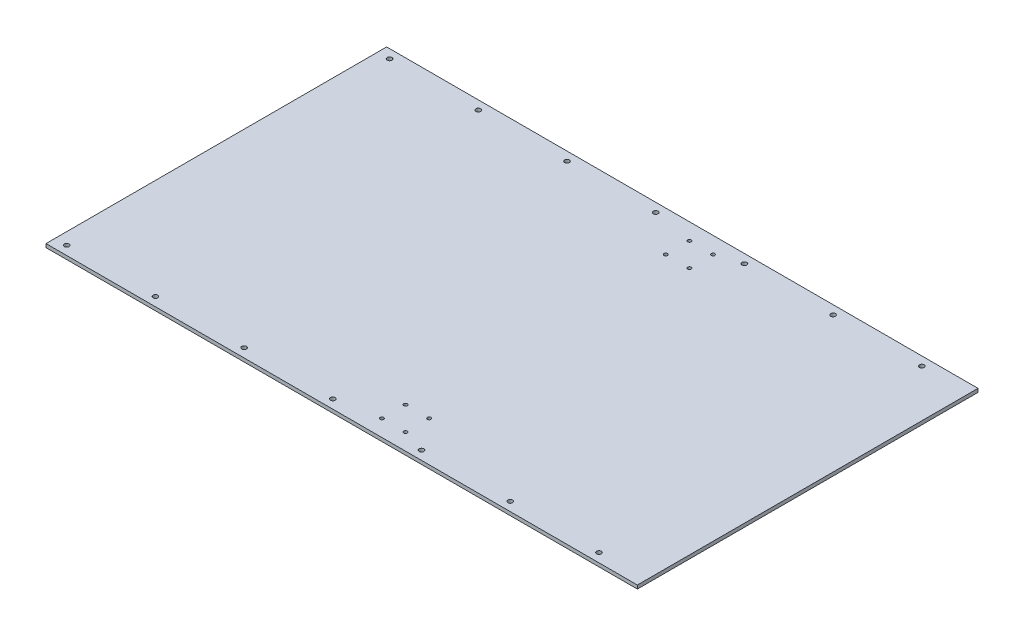
ISO-10303-21;
HEADER;
FILE_DESCRIPTION(('STEP AP214'),'2;1');
FILE_NAME('part.step','',(''),(''),'','','');
FILE_SCHEMA(('AUTOMOTIVE_DESIGN { 1 0 10303 214 1 1 1 1 }'));
ENDSEC;
DATA;
#1=APPLICATION_CONTEXT('core data for automotive mechanical design processes');
#2=APPLICATION_PROTOCOL_DEFINITION('international standard','automotive_design',2000,#1);
#3=PRODUCT_CONTEXT('',#1,'mechanical');
#4=PRODUCT('Part','Part','',(#3));
#5=PRODUCT_RELATED_PRODUCT_CATEGORY('part','',(#4));
#6=PRODUCT_DEFINITION_FORMATION('','',#4);
#7=PRODUCT_DEFINITION_CONTEXT('part definition',#1,'design');
#8=PRODUCT_DEFINITION('design','',#6,#7);
#9=PRODUCT_DEFINITION_SHAPE('','',#8);
#10=(LENGTH_UNIT() NAMED_UNIT(*) SI_UNIT(.MILLI.,.METRE.));
#11=(NAMED_UNIT(*) PLANE_ANGLE_UNIT() SI_UNIT($,.RADIAN.));
#12=(NAMED_UNIT(*) SI_UNIT($,.STERADIAN.) SOLID_ANGLE_UNIT());
#13=UNCERTAINTY_MEASURE_WITH_UNIT(LENGTH_MEASURE(1.E-05),#10,'distance_accuracy_value','');
#14=(GEOMETRIC_REPRESENTATION_CONTEXT(3) GLOBAL_UNCERTAINTY_ASSIGNED_CONTEXT((#13)) GLOBAL_UNIT_ASSIGNED_CONTEXT((#10,
#11,#12)) REPRESENTATION_CONTEXT('',''));
#15=CARTESIAN_POINT('',(0.,0.,0.));
#16=DIRECTION('',(0.,0.,1.));
#17=DIRECTION('',(1.,0.,0.));
#18=AXIS2_PLACEMENT_3D('',#15,#16,#17);
#19=CARTESIAN_POINT('',(-250.,3.,144.));
#20=DIRECTION('',(1.,0.,0.));
#21=DIRECTION('',(0.,0.,-1.));
#22=AXIS2_PLACEMENT_3D('',#19,#20,#21);
#23=PLANE('',#22);
#24=DIRECTION('',(0.,0.,1.));
#25=VECTOR('',#24,1.);
#26=CARTESIAN_POINT('',(-250.,0.,144.));
#27=LINE('',#26,#25);
#28=CARTESIAN_POINT('',(-250.,0.,-144.));
#29=VERTEX_POINT('',#28);
#30=CARTESIAN_POINT('',(-250.,0.,144.));
#31=VERTEX_POINT('',#30);
#32=EDGE_CURVE('E99',#29,#31,#27,.T.);
#33=ORIENTED_EDGE('',*,*,#32,.T.);
#34=DIRECTION('',(0.,-1.,0.));
#35=VECTOR('',#34,1.);
#36=CARTESIAN_POINT('',(-250.,3.,144.));
#37=LINE('',#36,#35);
#38=CARTESIAN_POINT('',(-250.,3.,144.));
#39=VERTEX_POINT('',#38);
#40=EDGE_CURVE('E11',#39,#31,#37,.T.);
#41=ORIENTED_EDGE('',*,*,#40,.F.);
#42=DIRECTION('',(0.,0.,1.));
#43=VECTOR('',#42,1.);
#44=CARTESIAN_POINT('',(-250.,3.,144.));
#45=LINE('',#44,#43);
#46=CARTESIAN_POINT('',(-250.,3.,-144.));
#47=VERTEX_POINT('',#46);
#48=EDGE_CURVE('E86',#47,#39,#45,.T.);
#49=ORIENTED_EDGE('',*,*,#48,.F.);
#50=DIRECTION('',(0.,-1.,0.));
#51=VECTOR('',#50,1.);
#52=CARTESIAN_POINT('',(-250.,3.,-144.));
#53=LINE('',#52,#51);
#54=EDGE_CURVE('E95',#47,#29,#53,.T.);
#55=ORIENTED_EDGE('',*,*,#54,.T.);
#56=EDGE_LOOP('',(#33,#41,#49,#55));
#57=FACE_BOUND('',#56,.T.);
#58=ADVANCED_FACE('F33',(#57),#23,.F.);
#59=CARTESIAN_POINT('',(250.,3.,144.));
#60=DIRECTION('',(0.,0.,-1.));
#61=DIRECTION('',(-1.,0.,0.));
#62=AXIS2_PLACEMENT_3D('',#59,#60,#61);
#63=PLANE('',#62);
#64=DIRECTION('',(1.,0.,0.));
#65=VECTOR('',#64,1.);
#66=CARTESIAN_POINT('',(250.,0.,144.));
#67=LINE('',#66,#65);
#68=CARTESIAN_POINT('',(250.,0.,144.));
#69=VERTEX_POINT('',#68);
#70=EDGE_CURVE('E90',#31,#69,#67,.T.);
#71=ORIENTED_EDGE('',*,*,#70,.T.);
#72=DIRECTION('',(0.,-1.,0.));
#73=VECTOR('',#72,1.);
#74=CARTESIAN_POINT('',(250.,3.,144.));
#75=LINE('',#74,#73);
#76=CARTESIAN_POINT('',(250.,3.,144.));
#77=VERTEX_POINT('',#76);
#78=EDGE_CURVE('E42',#77,#69,#75,.T.);
#79=ORIENTED_EDGE('',*,*,#78,.F.);
#80=DIRECTION('',(1.,0.,0.));
#81=VECTOR('',#80,1.);
#82=CARTESIAN_POINT('',(250.,3.,144.));
#83=LINE('',#82,#81);
#84=EDGE_CURVE('E81',#39,#77,#83,.T.);
#85=ORIENTED_EDGE('',*,*,#84,.F.);
#86=ORIENTED_EDGE('',*,*,#40,.T.);
#87=EDGE_LOOP('',(#71,#79,#85,#86));
#88=FACE_BOUND('',#87,.T.);
#89=ADVANCED_FACE('F89',(#88),#63,.F.);
#90=CARTESIAN_POINT('',(250.,3.,144.));
#91=DIRECTION('',(-1.,0.,0.));
#92=DIRECTION('',(0.,0.,1.));
#93=AXIS2_PLACEMENT_3D('',#90,#91,#92);
#94=PLANE('',#93);
#95=DIRECTION('',(0.,0.,-1.));
#96=VECTOR('',#95,1.);
#97=CARTESIAN_POINT('',(250.,0.,144.));
#98=LINE('',#97,#96);
#99=CARTESIAN_POINT('',(250.,0.,-144.));
#100=VERTEX_POINT('',#99);
#101=EDGE_CURVE('E68',#69,#100,#98,.T.);
#102=ORIENTED_EDGE('',*,*,#101,.T.);
#103=DIRECTION('',(0.,-1.,0.));
#104=VECTOR('',#103,1.);
#105=CARTESIAN_POINT('',(250.,3.,-144.));
#106=LINE('',#105,#104);
#107=CARTESIAN_POINT('',(250.,3.,-144.));
#108=VERTEX_POINT('',#107);
#109=EDGE_CURVE('E91',#108,#100,#106,.T.);
#110=ORIENTED_EDGE('',*,*,#109,.F.);
#111=DIRECTION('',(0.,0.,-1.));
#112=VECTOR('',#111,1.);
#113=CARTESIAN_POINT('',(250.,3.,144.));
#114=LINE('',#113,#112);
#115=EDGE_CURVE('E84',#77,#108,#114,.T.);
#116=ORIENTED_EDGE('',*,*,#115,.F.);
#117=ORIENTED_EDGE('',*,*,#78,.T.);
#118=EDGE_LOOP('',(#102,#110,#116,#117));
#119=FACE_BOUND('',#118,.T.);
#120=ADVANCED_FACE('F93',(#119),#94,.F.);
#121=CARTESIAN_POINT('',(250.,3.,-144.));
#122=DIRECTION('',(0.,0.,1.));
#123=DIRECTION('',(1.,0.,0.));
#124=AXIS2_PLACEMENT_3D('',#121,#122,#123);
#125=PLANE('',#124);
#126=DIRECTION('',(-1.,0.,0.));
#127=VECTOR('',#126,1.);
#128=CARTESIAN_POINT('',(250.,0.,-144.));
#129=LINE('',#128,#127);
#130=EDGE_CURVE('E74',#100,#29,#129,.T.);
#131=ORIENTED_EDGE('',*,*,#130,.T.);
#132=ORIENTED_EDGE('',*,*,#54,.F.);
#133=DIRECTION('',(-1.,0.,0.));
#134=VECTOR('',#133,1.);
#135=CARTESIAN_POINT('',(250.,3.,-144.));
#136=LINE('',#135,#134);
#137=EDGE_CURVE('E51',#108,#47,#136,.T.);
#138=ORIENTED_EDGE('',*,*,#137,.F.);
#139=ORIENTED_EDGE('',*,*,#109,.T.);
#140=EDGE_LOOP('',(#131,#132,#138,#139));
#141=FACE_BOUND('',#140,.T.);
#142=ADVANCED_FACE('F189',(#141),#125,.F.);
#143=CARTESIAN_POINT('',(0.,3.,0.));
#144=DIRECTION('',(0.,1.,0.));
#145=DIRECTION('',(0.,0.,1.));
#146=AXIS2_PLACEMENT_3D('',#143,#144,#145);
#147=PLANE('',#146);
#148=CARTESIAN_POINT('',(20.0000000000043,3.,-129.999999999998));
#149=DIRECTION('',(0.,1.,0.));
#150=DIRECTION('',(0.,0.,1.));
#151=AXIS2_PLACEMENT_3D('',#148,#149,#150);
#152=CIRCLE('',#151,1.5);
#153=CARTESIAN_POINT('',(20.0000000000043,3.,-128.499999999998));
#154=VERTEX_POINT('',#153);
#155=EDGE_CURVE('E394',#154,#154,#152,.T.);
#156=ORIENTED_EDGE('',*,*,#155,.F.);
#157=EDGE_LOOP('',(#156));
#158=FACE_BOUND('',#157,.T.);
#159=CARTESIAN_POINT('',(40.0000000000052,3.,-109.999999999997));
#160=DIRECTION('',(0.,1.,0.));
#161=DIRECTION('',(0.,0.,1.));
#162=AXIS2_PLACEMENT_3D('',#159,#160,#161);
#163=CIRCLE('',#162,1.5);
#164=CARTESIAN_POINT('',(40.0000000000052,3.,-108.499999999997));
#165=VERTEX_POINT('',#164);
#166=EDGE_CURVE('E434',#165,#165,#163,.T.);
#167=ORIENTED_EDGE('',*,*,#166,.F.);
#168=EDGE_LOOP('',(#167));
#169=FACE_BOUND('',#168,.T.);
#170=CARTESIAN_POINT('',(20.0000000000052,3.,-109.999999999997));
#171=DIRECTION('',(0.,1.,0.));
#172=DIRECTION('',(0.,0.,1.));
#173=AXIS2_PLACEMENT_3D('',#170,#171,#172);
#174=CIRCLE('',#173,1.5);
#175=CARTESIAN_POINT('',(20.0000000000052,3.,-108.499999999997));
#176=VERTEX_POINT('',#175);
#177=EDGE_CURVE('E431',#176,#176,#174,.T.);
#178=ORIENTED_EDGE('',*,*,#177,.F.);
#179=EDGE_LOOP('',(#178));
#180=FACE_BOUND('',#179,.T.);
#181=CARTESIAN_POINT('',(40.0000000000068,3.,110.000000000003));
#182=DIRECTION('',(0.,1.,0.));
#183=DIRECTION('',(0.,0.,1.));
#184=AXIS2_PLACEMENT_3D('',#181,#182,#183);
#185=CIRCLE('',#184,1.5);
#186=CARTESIAN_POINT('',(40.0000000000068,3.,111.500000000003));
#187=VERTEX_POINT('',#186);
#188=EDGE_CURVE('E428',#187,#187,#185,.T.);
#189=ORIENTED_EDGE('',*,*,#188,.F.);
#190=EDGE_LOOP('',(#189));
#191=FACE_BOUND('',#190,.T.);
#192=CARTESIAN_POINT('',(40.0000000000069,3.,130.000000000003));
#193=DIRECTION('',(0.,1.,0.));
#194=DIRECTION('',(0.,0.,1.));
#195=AXIS2_PLACEMENT_3D('',#192,#193,#194);
#196=CIRCLE('',#195,1.49999999999999);
#197=CARTESIAN_POINT('',(40.0000000000069,3.,131.500000000003));
#198=VERTEX_POINT('',#197);
#199=EDGE_CURVE('E425',#198,#198,#196,.T.);
#200=ORIENTED_EDGE('',*,*,#199,.F.);
#201=EDGE_LOOP('',(#200));
#202=FACE_BOUND('',#201,.T.);
#203=CARTESIAN_POINT('',(20.0000000000069,3.,130.000000000003));
#204=DIRECTION('',(0.,1.,0.));
#205=DIRECTION('',(0.,0.,1.));
#206=AXIS2_PLACEMENT_3D('',#203,#204,#205);
#207=CIRCLE('',#206,1.49999999999999);
#208=CARTESIAN_POINT('',(20.0000000000069,3.,131.500000000003));
#209=VERTEX_POINT('',#208);
#210=EDGE_CURVE('E422',#209,#209,#207,.T.);
#211=ORIENTED_EDGE('',*,*,#210,.F.);
#212=EDGE_LOOP('',(#211));
#213=FACE_BOUND('',#212,.T.);
#214=CARTESIAN_POINT('',(40.0000000000051,3.,-129.999999999997));
#215=DIRECTION('',(0.,1.,0.));
#216=DIRECTION('',(0.,0.,1.));
#217=AXIS2_PLACEMENT_3D('',#214,#215,#216);
#218=CIRCLE('',#217,1.49999999999998);
#219=CARTESIAN_POINT('',(40.0000000000051,3.,-128.499999999997));
#220=VERTEX_POINT('',#219);
#221=EDGE_CURVE('E419',#220,#220,#218,.T.);
#222=ORIENTED_EDGE('',*,*,#221,.F.);
#223=EDGE_LOOP('',(#222));
#224=FACE_BOUND('',#223,.T.);
#225=CARTESIAN_POINT('',(20.0000000000068,3.,110.000000000003));
#226=DIRECTION('',(0.,1.,0.));
#227=DIRECTION('',(0.,0.,1.));
#228=AXIS2_PLACEMENT_3D('',#225,#226,#227);
#229=CIRCLE('',#228,1.5);
#230=CARTESIAN_POINT('',(20.0000000000068,3.,111.500000000003));
#231=VERTEX_POINT('',#230);
#232=EDGE_CURVE('E416',#231,#231,#229,.T.);
#233=ORIENTED_EDGE('',*,*,#232,.F.);
#234=EDGE_LOOP('',(#233));
#235=FACE_BOUND('',#234,.T.);
#236=CARTESIAN_POINT('',(-15.,3.,136.5));
#237=DIRECTION('',(0.,1.,0.));
#238=DIRECTION('',(0.,0.,-1.));
#239=AXIS2_PLACEMENT_3D('',#236,#237,#238);
#240=CIRCLE('',#239,2.);
#241=CARTESIAN_POINT('',(-15.,3.,134.5));
#242=VERTEX_POINT('',#241);
#243=EDGE_CURVE('E451',#242,#242,#240,.T.);
#244=ORIENTED_EDGE('',*,*,#243,.F.);
#245=EDGE_LOOP('',(#244));
#246=FACE_BOUND('',#245,.T.);
#247=CARTESIAN_POINT('',(60.,3.,136.5));
#248=DIRECTION('',(0.,1.,0.));
#249=DIRECTION('',(0.,0.,-1.));
#250=AXIS2_PLACEMENT_3D('',#247,#248,#249);
#251=CIRCLE('',#250,2.);
#252=CARTESIAN_POINT('',(60.,3.,134.5));
#253=VERTEX_POINT('',#252);
#254=EDGE_CURVE('E461',#253,#253,#251,.T.);
#255=ORIENTED_EDGE('',*,*,#254,.F.);
#256=EDGE_LOOP('',(#255));
#257=FACE_BOUND('',#256,.T.);
#258=CARTESIAN_POINT('',(135.,3.,136.5));
#259=DIRECTION('',(0.,1.,0.));
#260=DIRECTION('',(0.,0.,-1.));
#261=AXIS2_PLACEMENT_3D('',#258,#259,#260);
#262=CIRCLE('',#261,2.);
#263=CARTESIAN_POINT('',(135.,3.,134.5));
#264=VERTEX_POINT('',#263);
#265=EDGE_CURVE('E458',#264,#264,#262,.T.);
#266=ORIENTED_EDGE('',*,*,#265,.F.);
#267=EDGE_LOOP('',(#266));
#268=FACE_BOUND('',#267,.T.);
#269=CARTESIAN_POINT('',(135.,3.,-136.5));
#270=DIRECTION('',(0.,1.,0.));
#271=DIRECTION('',(0.,0.,1.));
#272=AXIS2_PLACEMENT_3D('',#269,#270,#271);
#273=CIRCLE('',#272,2.);
#274=CARTESIAN_POINT('',(135.,3.,-134.5));
#275=VERTEX_POINT('',#274);
#276=EDGE_CURVE('E454',#275,#275,#273,.T.);
#277=ORIENTED_EDGE('',*,*,#276,.F.);
#278=EDGE_LOOP('',(#277));
#279=FACE_BOUND('',#278,.T.);
#280=CARTESIAN_POINT('',(60.,3.,-136.5));
#281=DIRECTION('',(0.,1.,0.));
#282=DIRECTION('',(0.,0.,1.));
#283=AXIS2_PLACEMENT_3D('',#280,#281,#282);
#284=CIRCLE('',#283,2.);
#285=CARTESIAN_POINT('',(60.,3.,-134.5));
#286=VERTEX_POINT('',#285);
#287=EDGE_CURVE('E457',#286,#286,#284,.T.);
#288=ORIENTED_EDGE('',*,*,#287,.F.);
#289=EDGE_LOOP('',(#288));
#290=FACE_BOUND('',#289,.T.);
#291=CARTESIAN_POINT('',(-15.,3.,-136.5));
#292=DIRECTION('',(0.,1.,0.));
#293=DIRECTION('',(0.,0.,1.));
#294=AXIS2_PLACEMENT_3D('',#291,#292,#293);
#295=CIRCLE('',#294,2.);
#296=CARTESIAN_POINT('',(-15.,3.,-134.5));
#297=VERTEX_POINT('',#296);
#298=EDGE_CURVE('E471',#297,#297,#295,.T.);
#299=ORIENTED_EDGE('',*,*,#298,.F.);
#300=EDGE_LOOP('',(#299));
#301=FACE_BOUND('',#300,.T.);
#302=CARTESIAN_POINT('',(-90.,3.,-136.5));
#303=DIRECTION('',(0.,1.,0.));
#304=DIRECTION('',(0.,0.,1.));
#305=AXIS2_PLACEMENT_3D('',#302,#303,#304);
#306=CIRCLE('',#305,2.);
#307=CARTESIAN_POINT('',(-90.,3.,-134.5));
#308=VERTEX_POINT('',#307);
#309=EDGE_CURVE('E468',#308,#308,#306,.T.);
#310=ORIENTED_EDGE('',*,*,#309,.F.);
#311=EDGE_LOOP('',(#310));
#312=FACE_BOUND('',#311,.T.);
#313=CARTESIAN_POINT('',(-165.,3.,-136.5));
#314=DIRECTION('',(0.,1.,0.));
#315=DIRECTION('',(0.,0.,1.));
#316=AXIS2_PLACEMENT_3D('',#313,#314,#315);
#317=CIRCLE('',#316,2.);
#318=CARTESIAN_POINT('',(-165.,3.,-134.5));
#319=VERTEX_POINT('',#318);
#320=EDGE_CURVE('E465',#319,#319,#317,.T.);
#321=ORIENTED_EDGE('',*,*,#320,.F.);
#322=EDGE_LOOP('',(#321));
#323=FACE_BOUND('',#322,.T.);
#324=CARTESIAN_POINT('',(210.,3.,136.5));
#325=DIRECTION('',(0.,1.,0.));
#326=DIRECTION('',(0.,0.,-1.));
#327=AXIS2_PLACEMENT_3D('',#324,#325,#326);
#328=CIRCLE('',#327,2.);
#329=CARTESIAN_POINT('',(210.,3.,134.5));
#330=VERTEX_POINT('',#329);
#331=EDGE_CURVE('E438',#330,#330,#328,.T.);
#332=ORIENTED_EDGE('',*,*,#331,.F.);
#333=EDGE_LOOP('',(#332));
#334=FACE_BOUND('',#333,.T.);
#335=CARTESIAN_POINT('',(-90.,3.,136.5));
#336=DIRECTION('',(0.,1.,0.));
#337=DIRECTION('',(0.,0.,-1.));
#338=AXIS2_PLACEMENT_3D('',#335,#336,#337);
#339=CIRCLE('',#338,2.);
#340=CARTESIAN_POINT('',(-90.,3.,134.5));
#341=VERTEX_POINT('',#340);
#342=EDGE_CURVE('E448',#341,#341,#339,.T.);
#343=ORIENTED_EDGE('',*,*,#342,.F.);
#344=EDGE_LOOP('',(#343));
#345=FACE_BOUND('',#344,.T.);
#346=CARTESIAN_POINT('',(-165.,3.,136.5));
#347=DIRECTION('',(0.,1.,0.));
#348=DIRECTION('',(0.,0.,-1.));
#349=AXIS2_PLACEMENT_3D('',#346,#347,#348);
#350=CIRCLE('',#349,2.);
#351=CARTESIAN_POINT('',(-165.,3.,134.5));
#352=VERTEX_POINT('',#351);
#353=EDGE_CURVE('E445',#352,#352,#350,.T.);
#354=ORIENTED_EDGE('',*,*,#353,.F.);
#355=EDGE_LOOP('',(#354));
#356=FACE_BOUND('',#355,.T.);
#357=CARTESIAN_POINT('',(-240.,3.,136.5));
#358=DIRECTION('',(0.,1.,0.));
#359=DIRECTION('',(0.,0.,-1.));
#360=AXIS2_PLACEMENT_3D('',#357,#358,#359);
#361=CIRCLE('',#360,2.);
#362=CARTESIAN_POINT('',(-240.,3.,134.5));
#363=VERTEX_POINT('',#362);
#364=EDGE_CURVE('E442',#363,#363,#361,.T.);
#365=ORIENTED_EDGE('',*,*,#364,.F.);
#366=EDGE_LOOP('',(#365));
#367=FACE_BOUND('',#366,.T.);
#368=CARTESIAN_POINT('',(210.,3.,-136.5));
#369=DIRECTION('',(0.,1.,0.));
#370=DIRECTION('',(0.,0.,1.));
#371=AXIS2_PLACEMENT_3D('',#368,#369,#370);
#372=CIRCLE('',#371,2.);
#373=CARTESIAN_POINT('',(210.,3.,-134.5));
#374=VERTEX_POINT('',#373);
#375=EDGE_CURVE('E441',#374,#374,#372,.T.);
#376=ORIENTED_EDGE('',*,*,#375,.F.);
#377=EDGE_LOOP('',(#376));
#378=FACE_BOUND('',#377,.T.);
#379=CARTESIAN_POINT('',(-240.,3.,-136.5));
#380=DIRECTION('',(0.,1.,0.));
#381=DIRECTION('',(0.,0.,1.));
#382=AXIS2_PLACEMENT_3D('',#379,#380,#381);
#383=CIRCLE('',#382,2.);
#384=CARTESIAN_POINT('',(-240.,3.,-134.5));
#385=VERTEX_POINT('',#384);
#386=EDGE_CURVE('E111',#385,#385,#383,.T.);
#387=ORIENTED_EDGE('',*,*,#386,.F.);
#388=EDGE_LOOP('',(#387));
#389=FACE_BOUND('',#388,.T.);
#390=ORIENTED_EDGE('',*,*,#48,.T.);
#391=ORIENTED_EDGE('',*,*,#84,.T.);
#392=ORIENTED_EDGE('',*,*,#115,.T.);
#393=ORIENTED_EDGE('',*,*,#137,.T.);
#394=EDGE_LOOP('',(#390,#391,#392,#393));
#395=FACE_BOUND('',#394,.T.);
#396=ADVANCED_FACE('F82',(#158,#169,#180,#191,#202,#213,#224,#235,#246,#257,#268,#279,#290,#301,
#312,#323,#334,#345,#356,#367,#378,#389,#395),#147,.T.);
#397=CARTESIAN_POINT('',(0.,0.,0.));
#398=DIRECTION('',(0.,1.,0.));
#399=DIRECTION('',(0.,0.,1.));
#400=AXIS2_PLACEMENT_3D('',#397,#398,#399);
#401=PLANE('',#400);
#402=CARTESIAN_POINT('',(20.0000000000043,0.,-129.999999999998));
#403=DIRECTION('',(0.,-1.,0.));
#404=DIRECTION('',(0.,0.,-1.));
#405=AXIS2_PLACEMENT_3D('',#402,#403,#404);
#406=CIRCLE('',#405,1.5);
#407=CARTESIAN_POINT('',(20.0000000000043,0.,-131.499999999998));
#408=VERTEX_POINT('',#407);
#409=EDGE_CURVE('E396',#408,#408,#406,.T.);
#410=ORIENTED_EDGE('',*,*,#409,.F.);
#411=EDGE_LOOP('',(#410));
#412=FACE_BOUND('',#411,.T.);
#413=CARTESIAN_POINT('',(40.0000000000052,0.,-109.999999999997));
#414=DIRECTION('',(0.,-1.,0.));
#415=DIRECTION('',(0.,0.,-1.));
#416=AXIS2_PLACEMENT_3D('',#413,#414,#415);
#417=CIRCLE('',#416,1.5);
#418=CARTESIAN_POINT('',(40.0000000000052,0.,-111.499999999997));
#419=VERTEX_POINT('',#418);
#420=EDGE_CURVE('E397',#419,#419,#417,.T.);
#421=ORIENTED_EDGE('',*,*,#420,.F.);
#422=EDGE_LOOP('',(#421));
#423=FACE_BOUND('',#422,.T.);
#424=CARTESIAN_POINT('',(20.0000000000052,0.,-109.999999999997));
#425=DIRECTION('',(0.,-1.,0.));
#426=DIRECTION('',(0.,0.,-1.));
#427=AXIS2_PLACEMENT_3D('',#424,#425,#426);
#428=CIRCLE('',#427,1.5);
#429=CARTESIAN_POINT('',(20.0000000000052,0.,-111.499999999997));
#430=VERTEX_POINT('',#429);
#431=EDGE_CURVE('E401',#430,#430,#428,.T.);
#432=ORIENTED_EDGE('',*,*,#431,.F.);
#433=EDGE_LOOP('',(#432));
#434=FACE_BOUND('',#433,.T.);
#435=CARTESIAN_POINT('',(40.0000000000068,0.,110.000000000003));
#436=DIRECTION('',(0.,-1.,0.));
#437=DIRECTION('',(0.,0.,-1.));
#438=AXIS2_PLACEMENT_3D('',#435,#436,#437);
#439=CIRCLE('',#438,1.5);
#440=CARTESIAN_POINT('',(40.0000000000068,0.,108.500000000003));
#441=VERTEX_POINT('',#440);
#442=EDGE_CURVE('E408',#441,#441,#439,.T.);
#443=ORIENTED_EDGE('',*,*,#442,.F.);
#444=EDGE_LOOP('',(#443));
#445=FACE_BOUND('',#444,.T.);
#446=CARTESIAN_POINT('',(40.0000000000069,0.,130.000000000003));
#447=DIRECTION('',(0.,-1.,0.));
#448=DIRECTION('',(0.,0.,-1.));
#449=AXIS2_PLACEMENT_3D('',#446,#447,#448);
#450=CIRCLE('',#449,1.49999999999999);
#451=CARTESIAN_POINT('',(40.0000000000069,0.,128.500000000003));
#452=VERTEX_POINT('',#451);
#453=EDGE_CURVE('E567',#452,#452,#450,.T.);
#454=ORIENTED_EDGE('',*,*,#453,.F.);
#455=EDGE_LOOP('',(#454));
#456=FACE_BOUND('',#455,.T.);
#457=CARTESIAN_POINT('',(20.0000000000069,0.,130.000000000003));
#458=DIRECTION('',(0.,-1.,0.));
#459=DIRECTION('',(0.,0.,-1.));
#460=AXIS2_PLACEMENT_3D('',#457,#458,#459);
#461=CIRCLE('',#460,1.49999999999999);
#462=CARTESIAN_POINT('',(20.0000000000069,0.,128.500000000003));
#463=VERTEX_POINT('',#462);
#464=EDGE_CURVE('E404',#463,#463,#461,.T.);
#465=ORIENTED_EDGE('',*,*,#464,.F.);
#466=EDGE_LOOP('',(#465));
#467=FACE_BOUND('',#466,.T.);
#468=CARTESIAN_POINT('',(40.0000000000051,0.,-129.999999999997));
#469=DIRECTION('',(0.,-1.,0.));
#470=DIRECTION('',(0.,0.,-1.));
#471=AXIS2_PLACEMENT_3D('',#468,#469,#470);
#472=CIRCLE('',#471,1.49999999999998);
#473=CARTESIAN_POINT('',(40.0000000000051,0.,-131.499999999997));
#474=VERTEX_POINT('',#473);
#475=EDGE_CURVE('E398',#474,#474,#472,.T.);
#476=ORIENTED_EDGE('',*,*,#475,.F.);
#477=EDGE_LOOP('',(#476));
#478=FACE_BOUND('',#477,.T.);
#479=CARTESIAN_POINT('',(20.0000000000068,0.,110.000000000003));
#480=DIRECTION('',(0.,-1.,0.));
#481=DIRECTION('',(0.,0.,-1.));
#482=AXIS2_PLACEMENT_3D('',#479,#480,#481);
#483=CIRCLE('',#482,1.5);
#484=CARTESIAN_POINT('',(20.0000000000068,0.,108.500000000003));
#485=VERTEX_POINT('',#484);
#486=EDGE_CURVE('E411',#485,#485,#483,.T.);
#487=ORIENTED_EDGE('',*,*,#486,.F.);
#488=EDGE_LOOP('',(#487));
#489=FACE_BOUND('',#488,.T.);
#490=CARTESIAN_POINT('',(-15.,0.,136.5));
#491=DIRECTION('',(0.,1.,0.));
#492=DIRECTION('',(0.,0.,1.));
#493=AXIS2_PLACEMENT_3D('',#490,#491,#492);
#494=CIRCLE('',#493,2.);
#495=CARTESIAN_POINT('',(-15.,0.,138.5));
#496=VERTEX_POINT('',#495);
#497=EDGE_CURVE('E36',#496,#496,#494,.T.);
#498=ORIENTED_EDGE('',*,*,#497,.T.);
#499=EDGE_LOOP('',(#498));
#500=FACE_BOUND('',#499,.T.);
#501=CARTESIAN_POINT('',(60.,0.,136.5));
#502=DIRECTION('',(0.,1.,0.));
#503=DIRECTION('',(0.,0.,1.));
#504=AXIS2_PLACEMENT_3D('',#501,#502,#503);
#505=CIRCLE('',#504,2.);
#506=CARTESIAN_POINT('',(60.,0.,138.5));
#507=VERTEX_POINT('',#506);
#508=EDGE_CURVE('E143',#507,#507,#505,.T.);
#509=ORIENTED_EDGE('',*,*,#508,.T.);
#510=EDGE_LOOP('',(#509));
#511=FACE_BOUND('',#510,.T.);
#512=CARTESIAN_POINT('',(135.,0.,136.5));
#513=DIRECTION('',(0.,1.,0.));
#514=DIRECTION('',(0.,0.,1.));
#515=AXIS2_PLACEMENT_3D('',#512,#513,#514);
#516=CIRCLE('',#515,2.);
#517=CARTESIAN_POINT('',(135.,0.,138.5));
#518=VERTEX_POINT('',#517);
#519=EDGE_CURVE('E141',#518,#518,#516,.T.);
#520=ORIENTED_EDGE('',*,*,#519,.T.);
#521=EDGE_LOOP('',(#520));
#522=FACE_BOUND('',#521,.T.);
#523=CARTESIAN_POINT('',(135.,0.,-136.5));
#524=DIRECTION('',(0.,1.,0.));
#525=DIRECTION('',(0.,0.,1.));
#526=AXIS2_PLACEMENT_3D('',#523,#524,#525);
#527=CIRCLE('',#526,2.);
#528=CARTESIAN_POINT('',(135.,0.,-134.5));
#529=VERTEX_POINT('',#528);
#530=EDGE_CURVE('E138',#529,#529,#527,.T.);
#531=ORIENTED_EDGE('',*,*,#530,.T.);
#532=EDGE_LOOP('',(#531));
#533=FACE_BOUND('',#532,.T.);
#534=CARTESIAN_POINT('',(60.,0.,-136.5));
#535=DIRECTION('',(0.,1.,0.));
#536=DIRECTION('',(0.,0.,1.));
#537=AXIS2_PLACEMENT_3D('',#534,#535,#536);
#538=CIRCLE('',#537,2.);
#539=CARTESIAN_POINT('',(60.,0.,-134.5));
#540=VERTEX_POINT('',#539);
#541=EDGE_CURVE('E135',#540,#540,#538,.T.);
#542=ORIENTED_EDGE('',*,*,#541,.T.);
#543=EDGE_LOOP('',(#542));
#544=FACE_BOUND('',#543,.T.);
#545=CARTESIAN_POINT('',(-15.,0.,-136.5));
#546=DIRECTION('',(0.,1.,0.));
#547=DIRECTION('',(0.,0.,1.));
#548=AXIS2_PLACEMENT_3D('',#545,#546,#547);
#549=CIRCLE('',#548,2.);
#550=CARTESIAN_POINT('',(-15.,0.,-134.5));
#551=VERTEX_POINT('',#550);
#552=EDGE_CURVE('E132',#551,#551,#549,.T.);
#553=ORIENTED_EDGE('',*,*,#552,.T.);
#554=EDGE_LOOP('',(#553));
#555=FACE_BOUND('',#554,.T.);
#556=CARTESIAN_POINT('',(-90.,0.,-136.5));
#557=DIRECTION('',(0.,1.,0.));
#558=DIRECTION('',(0.,0.,1.));
#559=AXIS2_PLACEMENT_3D('',#556,#557,#558);
#560=CIRCLE('',#559,2.);
#561=CARTESIAN_POINT('',(-90.,0.,-134.5));
#562=VERTEX_POINT('',#561);
#563=EDGE_CURVE('E129',#562,#562,#560,.T.);
#564=ORIENTED_EDGE('',*,*,#563,.T.);
#565=EDGE_LOOP('',(#564));
#566=FACE_BOUND('',#565,.T.);
#567=CARTESIAN_POINT('',(-165.,0.,-136.5));
#568=DIRECTION('',(0.,1.,0.));
#569=DIRECTION('',(0.,0.,1.));
#570=AXIS2_PLACEMENT_3D('',#567,#568,#569);
#571=CIRCLE('',#570,2.);
#572=CARTESIAN_POINT('',(-165.,0.,-134.5));
#573=VERTEX_POINT('',#572);
#574=EDGE_CURVE('E126',#573,#573,#571,.T.);
#575=ORIENTED_EDGE('',*,*,#574,.T.);
#576=EDGE_LOOP('',(#575));
#577=FACE_BOUND('',#576,.T.);
#578=CARTESIAN_POINT('',(210.,0.,136.5));
#579=DIRECTION('',(0.,1.,0.));
#580=DIRECTION('',(0.,0.,1.));
#581=AXIS2_PLACEMENT_3D('',#578,#579,#580);
#582=CIRCLE('',#581,2.);
#583=CARTESIAN_POINT('',(210.,0.,138.5));
#584=VERTEX_POINT('',#583);
#585=EDGE_CURVE('E123',#584,#584,#582,.T.);
#586=ORIENTED_EDGE('',*,*,#585,.T.);
#587=EDGE_LOOP('',(#586));
#588=FACE_BOUND('',#587,.T.);
#589=CARTESIAN_POINT('',(-90.,0.,136.5));
#590=DIRECTION('',(0.,1.,0.));
#591=DIRECTION('',(0.,0.,1.));
#592=AXIS2_PLACEMENT_3D('',#589,#590,#591);
#593=CIRCLE('',#592,2.);
#594=CARTESIAN_POINT('',(-90.,0.,138.5));
#595=VERTEX_POINT('',#594);
#596=EDGE_CURVE('E120',#595,#595,#593,.T.);
#597=ORIENTED_EDGE('',*,*,#596,.T.);
#598=EDGE_LOOP('',(#597));
#599=FACE_BOUND('',#598,.T.);
#600=CARTESIAN_POINT('',(-165.,0.,136.5));
#601=DIRECTION('',(0.,1.,0.));
#602=DIRECTION('',(0.,0.,1.));
#603=AXIS2_PLACEMENT_3D('',#600,#601,#602);
#604=CIRCLE('',#603,2.);
#605=CARTESIAN_POINT('',(-165.,0.,138.5));
#606=VERTEX_POINT('',#605);
#607=EDGE_CURVE('E117',#606,#606,#604,.T.);
#608=ORIENTED_EDGE('',*,*,#607,.T.);
#609=EDGE_LOOP('',(#608));
#610=FACE_BOUND('',#609,.T.);
#611=CARTESIAN_POINT('',(-240.,0.,136.5));
#612=DIRECTION('',(0.,1.,0.));
#613=DIRECTION('',(0.,0.,1.));
#614=AXIS2_PLACEMENT_3D('',#611,#612,#613);
#615=CIRCLE('',#614,2.);
#616=CARTESIAN_POINT('',(-240.,0.,138.5));
#617=VERTEX_POINT('',#616);
#618=EDGE_CURVE('E114',#617,#617,#615,.T.);
#619=ORIENTED_EDGE('',*,*,#618,.T.);
#620=EDGE_LOOP('',(#619));
#621=FACE_BOUND('',#620,.T.);
#622=CARTESIAN_POINT('',(210.,0.,-136.5));
#623=DIRECTION('',(0.,1.,0.));
#624=DIRECTION('',(0.,0.,1.));
#625=AXIS2_PLACEMENT_3D('',#622,#623,#624);
#626=CIRCLE('',#625,2.);
#627=CARTESIAN_POINT('',(210.,0.,-134.5));
#628=VERTEX_POINT('',#627);
#629=EDGE_CURVE('E110',#628,#628,#626,.T.);
#630=ORIENTED_EDGE('',*,*,#629,.T.);
#631=EDGE_LOOP('',(#630));
#632=FACE_BOUND('',#631,.T.);
#633=CARTESIAN_POINT('',(-240.,0.,-136.5));
#634=DIRECTION('',(0.,1.,0.));
#635=DIRECTION('',(0.,0.,1.));
#636=AXIS2_PLACEMENT_3D('',#633,#634,#635);
#637=CIRCLE('',#636,2.);
#638=CARTESIAN_POINT('',(-240.,0.,-134.5));
#639=VERTEX_POINT('',#638);
#640=EDGE_CURVE('E107',#639,#639,#637,.T.);
#641=ORIENTED_EDGE('',*,*,#640,.T.);
#642=EDGE_LOOP('',(#641));
#643=FACE_BOUND('',#642,.T.);
#644=ORIENTED_EDGE('',*,*,#32,.F.);
#645=ORIENTED_EDGE('',*,*,#130,.F.);
#646=ORIENTED_EDGE('',*,*,#101,.F.);
#647=ORIENTED_EDGE('',*,*,#70,.F.);
#648=EDGE_LOOP('',(#644,#645,#646,#647));
#649=FACE_BOUND('',#648,.T.);
#650=ADVANCED_FACE('F150',(#412,#423,#434,#445,#456,#467,#478,#489,#500,#511,#522,#533,#544,
#555,#566,#577,#588,#599,#610,#621,#632,#643,#649),#401,.F.);
#651=CARTESIAN_POINT('',(-240.,-7.,-136.5));
#652=DIRECTION('',(0.,1.,0.));
#653=DIRECTION('',(0.,0.,1.));
#654=AXIS2_PLACEMENT_3D('',#651,#652,#653);
#655=CYLINDRICAL_SURFACE('',#654,2.);
#656=ORIENTED_EDGE('',*,*,#386,.T.);
#657=EDGE_LOOP('',(#656));
#658=FACE_BOUND('',#657,.T.);
#659=ORIENTED_EDGE('',*,*,#640,.F.);
#660=EDGE_LOOP('',(#659));
#661=FACE_BOUND('',#660,.T.);
#662=ADVANCED_FACE('F178',(#658,#661),#655,.F.);
#663=CARTESIAN_POINT('',(210.,-7.,-136.5));
#664=DIRECTION('',(0.,1.,0.));
#665=DIRECTION('',(0.,0.,1.));
#666=AXIS2_PLACEMENT_3D('',#663,#664,#665);
#667=CYLINDRICAL_SURFACE('',#666,2.);
#668=ORIENTED_EDGE('',*,*,#375,.T.);
#669=EDGE_LOOP('',(#668));
#670=FACE_BOUND('',#669,.T.);
#671=ORIENTED_EDGE('',*,*,#629,.F.);
#672=EDGE_LOOP('',(#671));
#673=FACE_BOUND('',#672,.T.);
#674=ADVANCED_FACE('F186',(#670,#673),#667,.F.);
#675=CARTESIAN_POINT('',(-240.,-7.,136.5));
#676=DIRECTION('',(0.,1.,0.));
#677=DIRECTION('',(0.,0.,1.));
#678=AXIS2_PLACEMENT_3D('',#675,#676,#677);
#679=CYLINDRICAL_SURFACE('',#678,2.);
#680=ORIENTED_EDGE('',*,*,#364,.T.);
#681=EDGE_LOOP('',(#680));
#682=FACE_BOUND('',#681,.T.);
#683=ORIENTED_EDGE('',*,*,#618,.F.);
#684=EDGE_LOOP('',(#683));
#685=FACE_BOUND('',#684,.T.);
#686=ADVANCED_FACE('F226',(#682,#685),#679,.F.);
#687=CARTESIAN_POINT('',(-165.,-7.,136.5));
#688=DIRECTION('',(0.,1.,0.));
#689=DIRECTION('',(0.,0.,1.));
#690=AXIS2_PLACEMENT_3D('',#687,#688,#689);
#691=CYLINDRICAL_SURFACE('',#690,2.);
#692=ORIENTED_EDGE('',*,*,#353,.T.);
#693=EDGE_LOOP('',(#692));
#694=FACE_BOUND('',#693,.T.);
#695=ORIENTED_EDGE('',*,*,#607,.F.);
#696=EDGE_LOOP('',(#695));
#697=FACE_BOUND('',#696,.T.);
#698=ADVANCED_FACE('F234',(#694,#697),#691,.F.);
#699=CARTESIAN_POINT('',(-90.,-7.,136.5));
#700=DIRECTION('',(0.,1.,0.));
#701=DIRECTION('',(0.,0.,1.));
#702=AXIS2_PLACEMENT_3D('',#699,#700,#701);
#703=CYLINDRICAL_SURFACE('',#702,2.);
#704=ORIENTED_EDGE('',*,*,#342,.T.);
#705=EDGE_LOOP('',(#704));
#706=FACE_BOUND('',#705,.T.);
#707=ORIENTED_EDGE('',*,*,#596,.F.);
#708=EDGE_LOOP('',(#707));
#709=FACE_BOUND('',#708,.T.);
#710=ADVANCED_FACE('F242',(#706,#709),#703,.F.);
#711=CARTESIAN_POINT('',(210.,-7.,136.5));
#712=DIRECTION('',(0.,1.,0.));
#713=DIRECTION('',(0.,0.,1.));
#714=AXIS2_PLACEMENT_3D('',#711,#712,#713);
#715=CYLINDRICAL_SURFACE('',#714,2.);
#716=ORIENTED_EDGE('',*,*,#331,.T.);
#717=EDGE_LOOP('',(#716));
#718=FACE_BOUND('',#717,.T.);
#719=ORIENTED_EDGE('',*,*,#585,.F.);
#720=EDGE_LOOP('',(#719));
#721=FACE_BOUND('',#720,.T.);
#722=ADVANCED_FACE('F250',(#718,#721),#715,.F.);
#723=CARTESIAN_POINT('',(-165.,-7.,-136.5));
#724=DIRECTION('',(0.,1.,0.));
#725=DIRECTION('',(0.,0.,1.));
#726=AXIS2_PLACEMENT_3D('',#723,#724,#725);
#727=CYLINDRICAL_SURFACE('',#726,2.);
#728=ORIENTED_EDGE('',*,*,#320,.T.);
#729=EDGE_LOOP('',(#728));
#730=FACE_BOUND('',#729,.T.);
#731=ORIENTED_EDGE('',*,*,#574,.F.);
#732=EDGE_LOOP('',(#731));
#733=FACE_BOUND('',#732,.T.);
#734=ADVANCED_FACE('F258',(#730,#733),#727,.F.);
#735=CARTESIAN_POINT('',(-90.,-7.,-136.5));
#736=DIRECTION('',(0.,1.,0.));
#737=DIRECTION('',(0.,0.,1.));
#738=AXIS2_PLACEMENT_3D('',#735,#736,#737);
#739=CYLINDRICAL_SURFACE('',#738,2.);
#740=ORIENTED_EDGE('',*,*,#309,.T.);
#741=EDGE_LOOP('',(#740));
#742=FACE_BOUND('',#741,.T.);
#743=ORIENTED_EDGE('',*,*,#563,.F.);
#744=EDGE_LOOP('',(#743));
#745=FACE_BOUND('',#744,.T.);
#746=ADVANCED_FACE('F266',(#742,#745),#739,.F.);
#747=CARTESIAN_POINT('',(-15.,-7.,-136.5));
#748=DIRECTION('',(0.,1.,0.));
#749=DIRECTION('',(0.,0.,1.));
#750=AXIS2_PLACEMENT_3D('',#747,#748,#749);
#751=CYLINDRICAL_SURFACE('',#750,2.);
#752=ORIENTED_EDGE('',*,*,#298,.T.);
#753=EDGE_LOOP('',(#752));
#754=FACE_BOUND('',#753,.T.);
#755=ORIENTED_EDGE('',*,*,#552,.F.);
#756=EDGE_LOOP('',(#755));
#757=FACE_BOUND('',#756,.T.);
#758=ADVANCED_FACE('F273',(#754,#757),#751,.F.);
#759=CARTESIAN_POINT('',(60.,-7.,-136.5));
#760=DIRECTION('',(0.,1.,0.));
#761=DIRECTION('',(0.,0.,1.));
#762=AXIS2_PLACEMENT_3D('',#759,#760,#761);
#763=CYLINDRICAL_SURFACE('',#762,2.);
#764=ORIENTED_EDGE('',*,*,#287,.T.);
#765=EDGE_LOOP('',(#764));
#766=FACE_BOUND('',#765,.T.);
#767=ORIENTED_EDGE('',*,*,#541,.F.);
#768=EDGE_LOOP('',(#767));
#769=FACE_BOUND('',#768,.T.);
#770=ADVANCED_FACE('F281',(#766,#769),#763,.F.);
#771=CARTESIAN_POINT('',(135.,-7.,-136.5));
#772=DIRECTION('',(0.,1.,0.));
#773=DIRECTION('',(0.,0.,1.));
#774=AXIS2_PLACEMENT_3D('',#771,#772,#773);
#775=CYLINDRICAL_SURFACE('',#774,2.);
#776=ORIENTED_EDGE('',*,*,#276,.T.);
#777=EDGE_LOOP('',(#776));
#778=FACE_BOUND('',#777,.T.);
#779=ORIENTED_EDGE('',*,*,#530,.F.);
#780=EDGE_LOOP('',(#779));
#781=FACE_BOUND('',#780,.T.);
#782=ADVANCED_FACE('F289',(#778,#781),#775,.F.);
#783=CARTESIAN_POINT('',(135.,-7.,136.5));
#784=DIRECTION('',(0.,1.,0.));
#785=DIRECTION('',(0.,0.,1.));
#786=AXIS2_PLACEMENT_3D('',#783,#784,#785);
#787=CYLINDRICAL_SURFACE('',#786,2.);
#788=ORIENTED_EDGE('',*,*,#265,.T.);
#789=EDGE_LOOP('',(#788));
#790=FACE_BOUND('',#789,.T.);
#791=ORIENTED_EDGE('',*,*,#519,.F.);
#792=EDGE_LOOP('',(#791));
#793=FACE_BOUND('',#792,.T.);
#794=ADVANCED_FACE('F165',(#790,#793),#787,.F.);
#795=CARTESIAN_POINT('',(60.,-7.,136.5));
#796=DIRECTION('',(0.,1.,0.));
#797=DIRECTION('',(0.,0.,1.));
#798=AXIS2_PLACEMENT_3D('',#795,#796,#797);
#799=CYLINDRICAL_SURFACE('',#798,2.);
#800=ORIENTED_EDGE('',*,*,#254,.T.);
#801=EDGE_LOOP('',(#800));
#802=FACE_BOUND('',#801,.T.);
#803=ORIENTED_EDGE('',*,*,#508,.F.);
#804=EDGE_LOOP('',(#803));
#805=FACE_BOUND('',#804,.T.);
#806=ADVANCED_FACE('F155',(#802,#805),#799,.F.);
#807=CARTESIAN_POINT('',(-15.,-7.,136.5));
#808=DIRECTION('',(0.,1.,0.));
#809=DIRECTION('',(0.,0.,1.));
#810=AXIS2_PLACEMENT_3D('',#807,#808,#809);
#811=CYLINDRICAL_SURFACE('',#810,2.);
#812=ORIENTED_EDGE('',*,*,#243,.T.);
#813=EDGE_LOOP('',(#812));
#814=FACE_BOUND('',#813,.T.);
#815=ORIENTED_EDGE('',*,*,#497,.F.);
#816=EDGE_LOOP('',(#815));
#817=FACE_BOUND('',#816,.T.);
#818=ADVANCED_FACE('F152',(#814,#817),#811,.F.);
#819=CARTESIAN_POINT('',(20.0000000000068,10.,110.000000000003));
#820=DIRECTION('',(0.,-1.,0.));
#821=DIRECTION('',(0.,0.,-1.));
#822=AXIS2_PLACEMENT_3D('',#819,#820,#821);
#823=CYLINDRICAL_SURFACE('',#822,1.5);
#824=ORIENTED_EDGE('',*,*,#232,.T.);
#825=EDGE_LOOP('',(#824));
#826=FACE_BOUND('',#825,.T.);
#827=ORIENTED_EDGE('',*,*,#486,.T.);
#828=EDGE_LOOP('',(#827));
#829=FACE_BOUND('',#828,.T.);
#830=ADVANCED_FACE('F154',(#826,#829),#823,.F.);
#831=CARTESIAN_POINT('',(40.0000000000051,10.,-129.999999999997));
#832=DIRECTION('',(0.,-1.,0.));
#833=DIRECTION('',(0.,0.,-1.));
#834=AXIS2_PLACEMENT_3D('',#831,#832,#833);
#835=CYLINDRICAL_SURFACE('',#834,1.49999999999998);
#836=ORIENTED_EDGE('',*,*,#221,.T.);
#837=EDGE_LOOP('',(#836));
#838=FACE_BOUND('',#837,.T.);
#839=ORIENTED_EDGE('',*,*,#475,.T.);
#840=EDGE_LOOP('',(#839));
#841=FACE_BOUND('',#840,.T.);
#842=ADVANCED_FACE('F162',(#838,#841),#835,.F.);
#843=CARTESIAN_POINT('',(20.0000000000069,10.,130.000000000003));
#844=DIRECTION('',(0.,-1.,0.));
#845=DIRECTION('',(0.,0.,-1.));
#846=AXIS2_PLACEMENT_3D('',#843,#844,#845);
#847=CYLINDRICAL_SURFACE('',#846,1.49999999999999);
#848=ORIENTED_EDGE('',*,*,#210,.T.);
#849=EDGE_LOOP('',(#848));
#850=FACE_BOUND('',#849,.T.);
#851=ORIENTED_EDGE('',*,*,#464,.T.);
#852=EDGE_LOOP('',(#851));
#853=FACE_BOUND('',#852,.T.);
#854=ADVANCED_FACE('F327',(#850,#853),#847,.F.);
#855=CARTESIAN_POINT('',(40.0000000000069,10.,130.000000000003));
#856=DIRECTION('',(0.,-1.,0.));
#857=DIRECTION('',(0.,0.,-1.));
#858=AXIS2_PLACEMENT_3D('',#855,#856,#857);
#859=CYLINDRICAL_SURFACE('',#858,1.49999999999999);
#860=ORIENTED_EDGE('',*,*,#199,.T.);
#861=EDGE_LOOP('',(#860));
#862=FACE_BOUND('',#861,.T.);
#863=ORIENTED_EDGE('',*,*,#453,.T.);
#864=EDGE_LOOP('',(#863));
#865=FACE_BOUND('',#864,.T.);
#866=ADVANCED_FACE('F336',(#862,#865),#859,.F.);
#867=CARTESIAN_POINT('',(40.0000000000068,10.,110.000000000003));
#868=DIRECTION('',(0.,-1.,0.));
#869=DIRECTION('',(0.,0.,-1.));
#870=AXIS2_PLACEMENT_3D('',#867,#868,#869);
#871=CYLINDRICAL_SURFACE('',#870,1.5);
#872=ORIENTED_EDGE('',*,*,#188,.T.);
#873=EDGE_LOOP('',(#872));
#874=FACE_BOUND('',#873,.T.);
#875=ORIENTED_EDGE('',*,*,#442,.T.);
#876=EDGE_LOOP('',(#875));
#877=FACE_BOUND('',#876,.T.);
#878=ADVANCED_FACE('F345',(#874,#877),#871,.F.);
#879=CARTESIAN_POINT('',(20.0000000000052,10.,-109.999999999997));
#880=DIRECTION('',(0.,-1.,0.));
#881=DIRECTION('',(0.,0.,-1.));
#882=AXIS2_PLACEMENT_3D('',#879,#880,#881);
#883=CYLINDRICAL_SURFACE('',#882,1.5);
#884=ORIENTED_EDGE('',*,*,#177,.T.);
#885=EDGE_LOOP('',(#884));
#886=FACE_BOUND('',#885,.T.);
#887=ORIENTED_EDGE('',*,*,#431,.T.);
#888=EDGE_LOOP('',(#887));
#889=FACE_BOUND('',#888,.T.);
#890=ADVANCED_FACE('F354',(#886,#889),#883,.F.);
#891=CARTESIAN_POINT('',(40.0000000000052,10.,-109.999999999997));
#892=DIRECTION('',(0.,-1.,0.));
#893=DIRECTION('',(0.,0.,-1.));
#894=AXIS2_PLACEMENT_3D('',#891,#892,#893);
#895=CYLINDRICAL_SURFACE('',#894,1.5);
#896=ORIENTED_EDGE('',*,*,#166,.T.);
#897=EDGE_LOOP('',(#896));
#898=FACE_BOUND('',#897,.T.);
#899=ORIENTED_EDGE('',*,*,#420,.T.);
#900=EDGE_LOOP('',(#899));
#901=FACE_BOUND('',#900,.T.);
#902=ADVANCED_FACE('F363',(#898,#901),#895,.F.);
#903=CARTESIAN_POINT('',(20.0000000000043,10.,-129.999999999998));
#904=DIRECTION('',(0.,-1.,0.));
#905=DIRECTION('',(0.,0.,-1.));
#906=AXIS2_PLACEMENT_3D('',#903,#904,#905);
#907=CYLINDRICAL_SURFACE('',#906,1.5);
#908=ORIENTED_EDGE('',*,*,#155,.T.);
#909=EDGE_LOOP('',(#908));
#910=FACE_BOUND('',#909,.T.);
#911=ORIENTED_EDGE('',*,*,#409,.T.);
#912=EDGE_LOOP('',(#911));
#913=FACE_BOUND('',#912,.T.);
#914=ADVANCED_FACE('F372',(#910,#913),#907,.F.);
#915=CLOSED_SHELL('',(#58,#89,#120,#142,#396,#650,#662,#674,#686,#698,#710,#722,#734,#746,#758,
#770,#782,#794,#806,#818,#830,#842,#854,#866,#878,#890,#902,#914));
#916=MANIFOLD_SOLID_BREP('B2',#915);
#917=ADVANCED_BREP_SHAPE_REPRESENTATION('',(#18,#916),#14);
#918=SHAPE_DEFINITION_REPRESENTATION(#9,#917);
ENDSEC;
END-ISO-10303-21;
